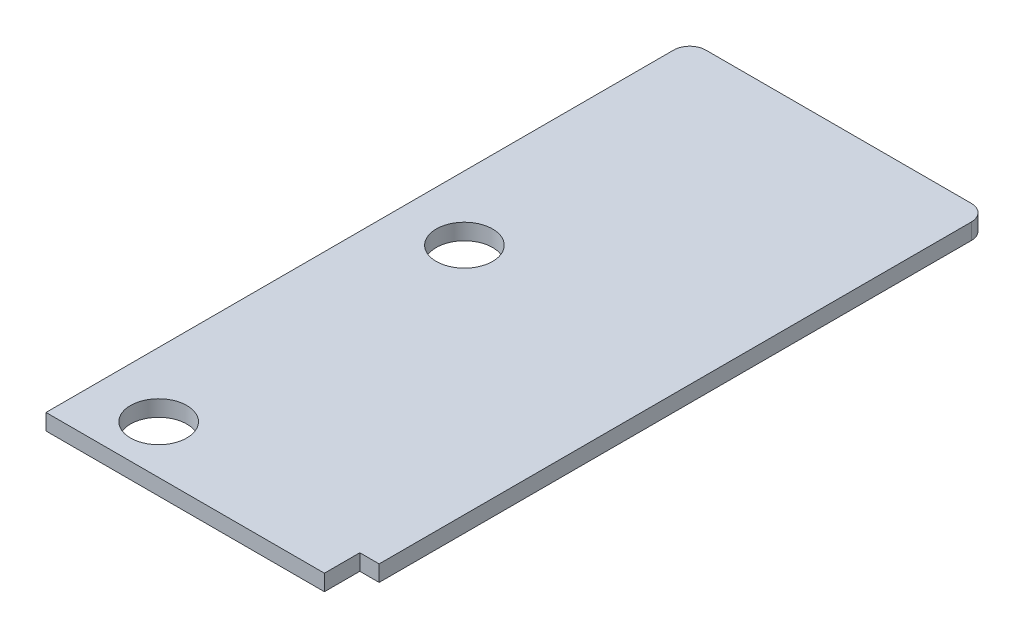
ISO-10303-21;
HEADER;
FILE_DESCRIPTION(('STEP AP214'),'2;1');
FILE_NAME('part.step','',(''),(''),'','','');
FILE_SCHEMA(('AUTOMOTIVE_DESIGN { 1 0 10303 214 1 1 1 1 }'));
ENDSEC;
DATA;
#1=APPLICATION_CONTEXT('core data for automotive mechanical design processes');
#2=APPLICATION_PROTOCOL_DEFINITION('international standard','automotive_design',2000,#1);
#3=PRODUCT_CONTEXT('',#1,'mechanical');
#4=PRODUCT('Part','Part','',(#3));
#5=PRODUCT_RELATED_PRODUCT_CATEGORY('part','',(#4));
#6=PRODUCT_DEFINITION_FORMATION('','',#4);
#7=PRODUCT_DEFINITION_CONTEXT('part definition',#1,'design');
#8=PRODUCT_DEFINITION('design','',#6,#7);
#9=PRODUCT_DEFINITION_SHAPE('','',#8);
#10=(LENGTH_UNIT() NAMED_UNIT(*) SI_UNIT(.MILLI.,.METRE.));
#11=(NAMED_UNIT(*) PLANE_ANGLE_UNIT() SI_UNIT($,.RADIAN.));
#12=(NAMED_UNIT(*) SI_UNIT($,.STERADIAN.) SOLID_ANGLE_UNIT());
#13=UNCERTAINTY_MEASURE_WITH_UNIT(LENGTH_MEASURE(1.E-05),#10,'distance_accuracy_value','');
#14=(GEOMETRIC_REPRESENTATION_CONTEXT(3) GLOBAL_UNCERTAINTY_ASSIGNED_CONTEXT((#13)) GLOBAL_UNIT_ASSIGNED_CONTEXT((#10,
#11,#12)) REPRESENTATION_CONTEXT('',''));
#15=CARTESIAN_POINT('',(0.,0.,0.));
#16=DIRECTION('',(0.,0.,1.));
#17=DIRECTION('',(1.,0.,0.));
#18=AXIS2_PLACEMENT_3D('',#15,#16,#17);
#19=CARTESIAN_POINT('',(0.,1.,0.));
#20=DIRECTION('',(0.,-1.,0.));
#21=DIRECTION('',(0.,0.,-1.));
#22=AXIS2_PLACEMENT_3D('',#19,#20,#21);
#23=PLANE('',#22);
#24=DIRECTION('',(-1.,0.,0.));
#25=VECTOR('',#24,1.);
#26=CARTESIAN_POINT('',(0.,1.,-40.));
#27=LINE('',#26,#25);
#28=CARTESIAN_POINT('',(17.5,1.,-40.));
#29=VERTEX_POINT('',#28);
#30=CARTESIAN_POINT('',(1.,1.,-40.));
#31=VERTEX_POINT('',#30);
#32=EDGE_CURVE('E182',#29,#31,#27,.T.);
#33=ORIENTED_EDGE('',*,*,#32,.T.);
#34=CARTESIAN_POINT('',(1.,1.,-39.));
#35=DIRECTION('',(0.,-1.,0.));
#36=DIRECTION('',(0.,0.,-1.));
#37=AXIS2_PLACEMENT_3D('',#34,#35,#36);
#38=CIRCLE('',#37,1.);
#39=CARTESIAN_POINT('',(0.,1.,-39.));
#40=VERTEX_POINT('',#39);
#41=EDGE_CURVE('E48',#31,#40,#38,.F.);
#42=ORIENTED_EDGE('',*,*,#41,.T.);
#43=DIRECTION('',(0.,0.,1.));
#44=VECTOR('',#43,1.);
#45=CARTESIAN_POINT('',(0.,1.,0.));
#46=LINE('',#45,#44);
#47=CARTESIAN_POINT('',(0.,1.,0.));
#48=VERTEX_POINT('',#47);
#49=EDGE_CURVE('E171',#40,#48,#46,.T.);
#50=ORIENTED_EDGE('',*,*,#49,.T.);
#51=DIRECTION('',(1.,0.,0.));
#52=VECTOR('',#51,1.);
#53=CARTESIAN_POINT('',(0.,1.,0.));
#54=LINE('',#53,#52);
#55=CARTESIAN_POINT('',(17.3,1.,0.));
#56=VERTEX_POINT('',#55);
#57=EDGE_CURVE('E174',#48,#56,#54,.T.);
#58=ORIENTED_EDGE('',*,*,#57,.T.);
#59=DIRECTION('',(0.,0.,1.));
#60=VECTOR('',#59,1.);
#61=CARTESIAN_POINT('',(17.3,1.,0.));
#62=LINE('',#61,#60);
#63=CARTESIAN_POINT('',(17.3,1.,-2.2));
#64=VERTEX_POINT('',#63);
#65=EDGE_CURVE('E146',#64,#56,#62,.T.);
#66=ORIENTED_EDGE('',*,*,#65,.F.);
#67=DIRECTION('',(-1.,0.,0.));
#68=VECTOR('',#67,1.);
#69=CARTESIAN_POINT('',(18.5,1.,-2.2));
#70=LINE('',#69,#68);
#71=CARTESIAN_POINT('',(18.5,1.,-2.2));
#72=VERTEX_POINT('',#71);
#73=EDGE_CURVE('E136',#72,#64,#70,.T.);
#74=ORIENTED_EDGE('',*,*,#73,.F.);
#75=DIRECTION('',(0.,0.,-1.));
#76=VECTOR('',#75,1.);
#77=CARTESIAN_POINT('',(18.5,1.,0.));
#78=LINE('',#77,#76);
#79=CARTESIAN_POINT('',(18.5,1.,-39.));
#80=VERTEX_POINT('',#79);
#81=EDGE_CURVE('E179',#72,#80,#78,.T.);
#82=ORIENTED_EDGE('',*,*,#81,.T.);
#83=CARTESIAN_POINT('',(17.5,1.,-39.));
#84=DIRECTION('',(0.,-1.,0.));
#85=DIRECTION('',(0.,0.,-1.));
#86=AXIS2_PLACEMENT_3D('',#83,#84,#85);
#87=CIRCLE('',#86,1.);
#88=EDGE_CURVE('E211',#80,#29,#87,.F.);
#89=ORIENTED_EDGE('',*,*,#88,.T.);
#90=EDGE_LOOP('',(#33,#42,#50,#58,#66,#74,#82,#89));
#91=FACE_BOUND('',#90,.T.);
#92=CARTESIAN_POINT('',(4.,1.,-3.));
#93=DIRECTION('',(0.,1.,0.));
#94=DIRECTION('',(0.,0.,1.));
#95=AXIS2_PLACEMENT_3D('',#92,#93,#94);
#96=CIRCLE('',#95,1.75);
#97=CARTESIAN_POINT('',(4.,1.,-1.25));
#98=VERTEX_POINT('',#97);
#99=EDGE_CURVE('E165',#98,#98,#96,.T.);
#100=ORIENTED_EDGE('',*,*,#99,.F.);
#101=EDGE_LOOP('',(#100));
#102=FACE_BOUND('',#101,.T.);
#103=CARTESIAN_POINT('',(4.,1.,-22.));
#104=DIRECTION('',(0.,1.,0.));
#105=DIRECTION('',(0.,0.,1.));
#106=AXIS2_PLACEMENT_3D('',#103,#104,#105);
#107=CIRCLE('',#106,1.75);
#108=CARTESIAN_POINT('',(4.,1.,-20.25));
#109=VERTEX_POINT('',#108);
#110=EDGE_CURVE('E159',#109,#109,#107,.T.);
#111=ORIENTED_EDGE('',*,*,#110,.F.);
#112=EDGE_LOOP('',(#111));
#113=FACE_BOUND('',#112,.T.);
#114=ADVANCED_FACE('F39',(#91,#102,#113),#23,.F.);
#115=CARTESIAN_POINT('',(0.,0.,0.));
#116=DIRECTION('',(0.,-1.,0.));
#117=DIRECTION('',(0.,0.,-1.));
#118=AXIS2_PLACEMENT_3D('',#115,#116,#117);
#119=PLANE('',#118);
#120=DIRECTION('',(0.,0.,1.));
#121=VECTOR('',#120,1.);
#122=CARTESIAN_POINT('',(0.,0.,0.));
#123=LINE('',#122,#121);
#124=CARTESIAN_POINT('',(0.,0.,-39.));
#125=VERTEX_POINT('',#124);
#126=CARTESIAN_POINT('',(0.,0.,0.));
#127=VERTEX_POINT('',#126);
#128=EDGE_CURVE('E168',#125,#127,#123,.T.);
#129=ORIENTED_EDGE('',*,*,#128,.F.);
#130=CARTESIAN_POINT('',(1.,0.,-39.));
#131=DIRECTION('',(0.,-1.,0.));
#132=DIRECTION('',(0.,0.,-1.));
#133=AXIS2_PLACEMENT_3D('',#130,#131,#132);
#134=CIRCLE('',#133,1.);
#135=CARTESIAN_POINT('',(1.,0.,-40.));
#136=VERTEX_POINT('',#135);
#137=EDGE_CURVE('E204',#125,#136,#134,.T.);
#138=ORIENTED_EDGE('',*,*,#137,.T.);
#139=DIRECTION('',(-1.,0.,0.));
#140=VECTOR('',#139,1.);
#141=CARTESIAN_POINT('',(0.,0.,-40.));
#142=LINE('',#141,#140);
#143=CARTESIAN_POINT('',(17.5,0.,-40.));
#144=VERTEX_POINT('',#143);
#145=EDGE_CURVE('E175',#144,#136,#142,.T.);
#146=ORIENTED_EDGE('',*,*,#145,.F.);
#147=CARTESIAN_POINT('',(17.5,0.,-39.));
#148=DIRECTION('',(0.,-1.,0.));
#149=DIRECTION('',(0.,0.,-1.));
#150=AXIS2_PLACEMENT_3D('',#147,#148,#149);
#151=CIRCLE('',#150,1.);
#152=CARTESIAN_POINT('',(18.5,0.,-39.));
#153=VERTEX_POINT('',#152);
#154=EDGE_CURVE('E201',#144,#153,#151,.T.);
#155=ORIENTED_EDGE('',*,*,#154,.T.);
#156=DIRECTION('',(0.,0.,-1.));
#157=VECTOR('',#156,1.);
#158=CARTESIAN_POINT('',(18.5,0.,0.));
#159=LINE('',#158,#157);
#160=CARTESIAN_POINT('',(18.5,0.,-2.2));
#161=VERTEX_POINT('',#160);
#162=EDGE_CURVE('E144',#161,#153,#159,.T.);
#163=ORIENTED_EDGE('',*,*,#162,.F.);
#164=DIRECTION('',(-1.,0.,0.));
#165=VECTOR('',#164,1.);
#166=CARTESIAN_POINT('',(18.5,0.,-2.2));
#167=LINE('',#166,#165);
#168=CARTESIAN_POINT('',(17.3,0.,-2.2));
#169=VERTEX_POINT('',#168);
#170=EDGE_CURVE('E133',#161,#169,#167,.T.);
#171=ORIENTED_EDGE('',*,*,#170,.T.);
#172=DIRECTION('',(0.,0.,1.));
#173=VECTOR('',#172,1.);
#174=CARTESIAN_POINT('',(17.3,0.,0.));
#175=LINE('',#174,#173);
#176=CARTESIAN_POINT('',(17.3,0.,0.));
#177=VERTEX_POINT('',#176);
#178=EDGE_CURVE('E118',#169,#177,#175,.T.);
#179=ORIENTED_EDGE('',*,*,#178,.T.);
#180=DIRECTION('',(1.,0.,0.));
#181=VECTOR('',#180,1.);
#182=CARTESIAN_POINT('',(0.,0.,0.));
#183=LINE('',#182,#181);
#184=EDGE_CURVE('E188',#127,#177,#183,.T.);
#185=ORIENTED_EDGE('',*,*,#184,.F.);
#186=EDGE_LOOP('',(#129,#138,#146,#155,#163,#171,#179,#185));
#187=FACE_BOUND('',#186,.T.);
#188=CARTESIAN_POINT('',(4.,0.,-3.));
#189=DIRECTION('',(0.,1.,0.));
#190=DIRECTION('',(0.,0.,1.));
#191=AXIS2_PLACEMENT_3D('',#188,#189,#190);
#192=CIRCLE('',#191,1.75);
#193=CARTESIAN_POINT('',(4.,0.,-1.25));
#194=VERTEX_POINT('',#193);
#195=EDGE_CURVE('E162',#194,#194,#192,.T.);
#196=ORIENTED_EDGE('',*,*,#195,.T.);
#197=EDGE_LOOP('',(#196));
#198=FACE_BOUND('',#197,.T.);
#199=CARTESIAN_POINT('',(4.,0.,-22.));
#200=DIRECTION('',(0.,1.,0.));
#201=DIRECTION('',(0.,0.,1.));
#202=AXIS2_PLACEMENT_3D('',#199,#200,#201);
#203=CIRCLE('',#202,1.75);
#204=CARTESIAN_POINT('',(4.,0.,-20.25));
#205=VERTEX_POINT('',#204);
#206=EDGE_CURVE('E158',#205,#205,#203,.T.);
#207=ORIENTED_EDGE('',*,*,#206,.T.);
#208=EDGE_LOOP('',(#207));
#209=FACE_BOUND('',#208,.T.);
#210=ADVANCED_FACE('F142',(#187,#198,#209),#119,.T.);
#211=CARTESIAN_POINT('',(0.,1.,0.));
#212=DIRECTION('',(1.,0.,0.));
#213=DIRECTION('',(0.,0.,-1.));
#214=AXIS2_PLACEMENT_3D('',#211,#212,#213);
#215=PLANE('',#214);
#216=ORIENTED_EDGE('',*,*,#49,.F.);
#217=DIRECTION('',(0.,-1.,0.));
#218=VECTOR('',#217,1.);
#219=CARTESIAN_POINT('',(0.,1.,-39.));
#220=LINE('',#219,#218);
#221=EDGE_CURVE('E198',#40,#125,#220,.T.);
#222=ORIENTED_EDGE('',*,*,#221,.T.);
#223=ORIENTED_EDGE('',*,*,#128,.T.);
#224=DIRECTION('',(0.,-1.,0.));
#225=VECTOR('',#224,1.);
#226=CARTESIAN_POINT('',(0.,1.,0.));
#227=LINE('',#226,#225);
#228=EDGE_CURVE('E185',#48,#127,#227,.T.);
#229=ORIENTED_EDGE('',*,*,#228,.F.);
#230=EDGE_LOOP('',(#216,#222,#223,#229));
#231=FACE_BOUND('',#230,.T.);
#232=ADVANCED_FACE('F222',(#231),#215,.F.);
#233=CARTESIAN_POINT('',(0.,1.,0.));
#234=DIRECTION('',(0.,0.,-1.));
#235=DIRECTION('',(-1.,0.,0.));
#236=AXIS2_PLACEMENT_3D('',#233,#234,#235);
#237=PLANE('',#236);
#238=ORIENTED_EDGE('',*,*,#184,.T.);
#239=DIRECTION('',(0.,1.,0.));
#240=VECTOR('',#239,1.);
#241=CARTESIAN_POINT('',(17.3,-2.50599281722833,0.));
#242=LINE('',#241,#240);
#243=EDGE_CURVE('E124',#177,#56,#242,.T.);
#244=ORIENTED_EDGE('',*,*,#243,.T.);
#245=ORIENTED_EDGE('',*,*,#57,.F.);
#246=ORIENTED_EDGE('',*,*,#228,.T.);
#247=EDGE_LOOP('',(#238,#244,#245,#246));
#248=FACE_BOUND('',#247,.T.);
#249=ADVANCED_FACE('F231',(#248),#237,.F.);
#250=CARTESIAN_POINT('',(18.5,1.,0.));
#251=DIRECTION('',(-1.,0.,0.));
#252=DIRECTION('',(0.,0.,1.));
#253=AXIS2_PLACEMENT_3D('',#250,#251,#252);
#254=PLANE('',#253);
#255=ORIENTED_EDGE('',*,*,#162,.T.);
#256=DIRECTION('',(0.,-1.,0.));
#257=VECTOR('',#256,1.);
#258=CARTESIAN_POINT('',(18.5,1.,-39.));
#259=LINE('',#258,#257);
#260=EDGE_CURVE('E11',#153,#80,#259,.F.);
#261=ORIENTED_EDGE('',*,*,#260,.T.);
#262=ORIENTED_EDGE('',*,*,#81,.F.);
#263=DIRECTION('',(0.,1.,0.));
#264=VECTOR('',#263,1.);
#265=CARTESIAN_POINT('',(18.5,-2.50599281722833,-2.2));
#266=LINE('',#265,#264);
#267=EDGE_CURVE('E155',#161,#72,#266,.T.);
#268=ORIENTED_EDGE('',*,*,#267,.F.);
#269=EDGE_LOOP('',(#255,#261,#262,#268));
#270=FACE_BOUND('',#269,.T.);
#271=ADVANCED_FACE('F229',(#270),#254,.F.);
#272=CARTESIAN_POINT('',(0.,1.,-40.));
#273=DIRECTION('',(0.,0.,1.));
#274=DIRECTION('',(1.,0.,0.));
#275=AXIS2_PLACEMENT_3D('',#272,#273,#274);
#276=PLANE('',#275);
#277=ORIENTED_EDGE('',*,*,#145,.T.);
#278=DIRECTION('',(0.,-1.,0.));
#279=VECTOR('',#278,1.);
#280=CARTESIAN_POINT('',(1.,1.,-40.));
#281=LINE('',#280,#279);
#282=EDGE_CURVE('E63',#136,#31,#281,.F.);
#283=ORIENTED_EDGE('',*,*,#282,.T.);
#284=ORIENTED_EDGE('',*,*,#32,.F.);
#285=DIRECTION('',(0.,-1.,0.));
#286=VECTOR('',#285,1.);
#287=CARTESIAN_POINT('',(17.5,1.,-40.));
#288=LINE('',#287,#286);
#289=EDGE_CURVE('E206',#29,#144,#288,.T.);
#290=ORIENTED_EDGE('',*,*,#289,.T.);
#291=EDGE_LOOP('',(#277,#283,#284,#290));
#292=FACE_BOUND('',#291,.T.);
#293=ADVANCED_FACE('F225',(#292),#276,.F.);
#294=CARTESIAN_POINT('',(4.,1.,-3.));
#295=DIRECTION('',(0.,-1.,0.));
#296=DIRECTION('',(0.,0.,-1.));
#297=AXIS2_PLACEMENT_3D('',#294,#295,#296);
#298=CYLINDRICAL_SURFACE('',#297,1.75);
#299=ORIENTED_EDGE('',*,*,#99,.T.);
#300=EDGE_LOOP('',(#299));
#301=FACE_BOUND('',#300,.T.);
#302=ORIENTED_EDGE('',*,*,#195,.F.);
#303=EDGE_LOOP('',(#302));
#304=FACE_BOUND('',#303,.T.);
#305=ADVANCED_FACE('F247',(#301,#304),#298,.F.);
#306=CARTESIAN_POINT('',(4.,1.,-22.));
#307=DIRECTION('',(0.,-1.,0.));
#308=DIRECTION('',(0.,0.,-1.));
#309=AXIS2_PLACEMENT_3D('',#306,#307,#308);
#310=CYLINDRICAL_SURFACE('',#309,1.75);
#311=ORIENTED_EDGE('',*,*,#110,.T.);
#312=EDGE_LOOP('',(#311));
#313=FACE_BOUND('',#312,.T.);
#314=ORIENTED_EDGE('',*,*,#206,.F.);
#315=EDGE_LOOP('',(#314));
#316=FACE_BOUND('',#315,.T.);
#317=ADVANCED_FACE('F254',(#313,#316),#310,.F.);
#318=CARTESIAN_POINT('',(18.5,-2.50599281722833,-2.2));
#319=DIRECTION('',(0.,0.,-1.));
#320=DIRECTION('',(-1.,0.,0.));
#321=AXIS2_PLACEMENT_3D('',#318,#319,#320);
#322=PLANE('',#321);
#323=ORIENTED_EDGE('',*,*,#267,.T.);
#324=ORIENTED_EDGE('',*,*,#73,.T.);
#325=DIRECTION('',(0.,1.,0.));
#326=VECTOR('',#325,1.);
#327=CARTESIAN_POINT('',(17.3,-2.50599281722833,-2.2));
#328=LINE('',#327,#326);
#329=EDGE_CURVE('E121',#169,#64,#328,.T.);
#330=ORIENTED_EDGE('',*,*,#329,.F.);
#331=ORIENTED_EDGE('',*,*,#170,.F.);
#332=EDGE_LOOP('',(#323,#324,#330,#331));
#333=FACE_BOUND('',#332,.T.);
#334=ADVANCED_FACE('F132',(#333),#322,.F.);
#335=CARTESIAN_POINT('',(17.3,-2.50599281722833,0.));
#336=DIRECTION('',(-1.,0.,0.));
#337=DIRECTION('',(0.,0.,1.));
#338=AXIS2_PLACEMENT_3D('',#335,#336,#337);
#339=PLANE('',#338);
#340=ORIENTED_EDGE('',*,*,#329,.T.);
#341=ORIENTED_EDGE('',*,*,#65,.T.);
#342=ORIENTED_EDGE('',*,*,#243,.F.);
#343=ORIENTED_EDGE('',*,*,#178,.F.);
#344=EDGE_LOOP('',(#340,#341,#342,#343));
#345=FACE_BOUND('',#344,.T.);
#346=ADVANCED_FACE('F120',(#345),#339,.F.);
#347=CARTESIAN_POINT('',(1.,1.,-39.));
#348=DIRECTION('',(0.,-1.,0.));
#349=DIRECTION('',(0.,0.,-1.));
#350=AXIS2_PLACEMENT_3D('',#347,#348,#349);
#351=CYLINDRICAL_SURFACE('',#350,1.);
#352=ORIENTED_EDGE('',*,*,#41,.F.);
#353=ORIENTED_EDGE('',*,*,#282,.F.);
#354=ORIENTED_EDGE('',*,*,#137,.F.);
#355=ORIENTED_EDGE('',*,*,#221,.F.);
#356=EDGE_LOOP('',(#352,#353,#354,#355));
#357=FACE_BOUND('',#356,.T.);
#358=ADVANCED_FACE('F223',(#357),#351,.T.);
#359=CARTESIAN_POINT('',(17.5,1.,-39.));
#360=DIRECTION('',(0.,-1.,0.));
#361=DIRECTION('',(0.,0.,-1.));
#362=AXIS2_PLACEMENT_3D('',#359,#360,#361);
#363=CYLINDRICAL_SURFACE('',#362,1.);
#364=ORIENTED_EDGE('',*,*,#88,.F.);
#365=ORIENTED_EDGE('',*,*,#260,.F.);
#366=ORIENTED_EDGE('',*,*,#154,.F.);
#367=ORIENTED_EDGE('',*,*,#289,.F.);
#368=EDGE_LOOP('',(#364,#365,#366,#367));
#369=FACE_BOUND('',#368,.T.);
#370=ADVANCED_FACE('F41',(#369),#363,.T.);
#371=CLOSED_SHELL('',(#114,#210,#232,#249,#271,#293,#305,#317,#334,#346,#358,#370));
#372=MANIFOLD_SOLID_BREP('B2',#371);
#373=ADVANCED_BREP_SHAPE_REPRESENTATION('',(#18,#372),#14);
#374=SHAPE_DEFINITION_REPRESENTATION(#9,#373);
ENDSEC;
END-ISO-10303-21;
